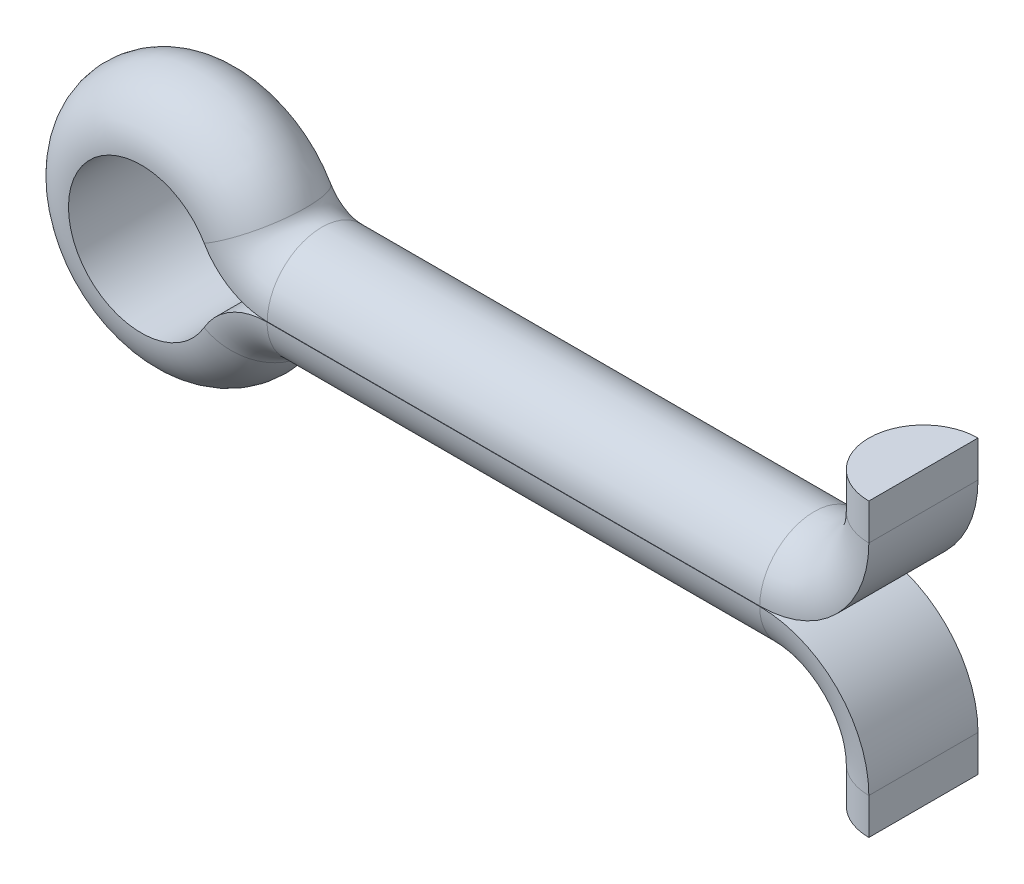
ISO-10303-21;
HEADER;
FILE_DESCRIPTION(('STEP AP214'),'2;1');
FILE_NAME('part.step','',(''),(''),'','','');
FILE_SCHEMA(('AUTOMOTIVE_DESIGN { 1 0 10303 214 1 1 1 1 }'));
ENDSEC;
DATA;
#1=APPLICATION_CONTEXT('core data for automotive mechanical design processes');
#2=APPLICATION_PROTOCOL_DEFINITION('international standard','automotive_design',2000,#1);
#3=PRODUCT_CONTEXT('',#1,'mechanical');
#4=PRODUCT('Part','Part','',(#3));
#5=PRODUCT_RELATED_PRODUCT_CATEGORY('part','',(#4));
#6=PRODUCT_DEFINITION_FORMATION('','',#4);
#7=PRODUCT_DEFINITION_CONTEXT('part definition',#1,'design');
#8=PRODUCT_DEFINITION('design','',#6,#7);
#9=PRODUCT_DEFINITION_SHAPE('','',#8);
#10=(LENGTH_UNIT() NAMED_UNIT(*) SI_UNIT(.MILLI.,.METRE.));
#11=(NAMED_UNIT(*) PLANE_ANGLE_UNIT() SI_UNIT($,.RADIAN.));
#12=(NAMED_UNIT(*) SI_UNIT($,.STERADIAN.) SOLID_ANGLE_UNIT());
#13=UNCERTAINTY_MEASURE_WITH_UNIT(LENGTH_MEASURE(1.E-05),#10,'distance_accuracy_value','');
#14=(GEOMETRIC_REPRESENTATION_CONTEXT(3) GLOBAL_UNCERTAINTY_ASSIGNED_CONTEXT((#13)) GLOBAL_UNIT_ASSIGNED_CONTEXT((#10,
#11,#12)) REPRESENTATION_CONTEXT('',''));
#15=CARTESIAN_POINT('',(0.,0.,0.));
#16=DIRECTION('',(0.,0.,1.));
#17=DIRECTION('',(1.,0.,0.));
#18=AXIS2_PLACEMENT_3D('',#15,#16,#17);
#19=CARTESIAN_POINT('',(20.,-4.00999999999986,0.));
#20=DIRECTION('',(0.,1.,0.));
#21=DIRECTION('',(0.,0.,1.));
#22=AXIS2_PLACEMENT_3D('',#19,#20,#21);
#23=PLANE('',#22);
#24=CARTESIAN_POINT('',(20.,-4.00999999999986,0.));
#25=DIRECTION('',(0.,1.,0.));
#26=DIRECTION('',(0.,0.,1.));
#27=AXIS2_PLACEMENT_3D('',#24,#25,#26);
#28=CIRCLE('',#27,1.5);
#29=CARTESIAN_POINT('',(20.,-4.00999999999986,-1.5));
#30=VERTEX_POINT('',#29);
#31=CARTESIAN_POINT('',(20.,-4.00999999999986,1.5));
#32=VERTEX_POINT('',#31);
#33=EDGE_CURVE('E103',#30,#32,#28,.T.);
#34=ORIENTED_EDGE('',*,*,#33,.F.);
#35=DIRECTION('',(0.,0.,-1.));
#36=VECTOR('',#35,1.);
#37=CARTESIAN_POINT('',(20.,-4.00999999999986,-1.5));
#38=LINE('',#37,#36);
#39=EDGE_CURVE('E105',#32,#30,#38,.T.);
#40=ORIENTED_EDGE('',*,*,#39,.F.);
#41=EDGE_LOOP('',(#34,#40));
#42=FACE_BOUND('',#41,.T.);
#43=ADVANCED_FACE('F33',(#42),#23,.F.);
#44=CARTESIAN_POINT('',(20.,4.,0.));
#45=DIRECTION('',(0.,1.,0.));
#46=DIRECTION('',(0.,0.,1.));
#47=AXIS2_PLACEMENT_3D('',#44,#45,#46);
#48=PLANE('',#47);
#49=CARTESIAN_POINT('',(20.,4.,0.));
#50=DIRECTION('',(0.,1.,0.));
#51=DIRECTION('',(0.,0.,1.));
#52=AXIS2_PLACEMENT_3D('',#49,#50,#51);
#53=CIRCLE('',#52,1.5);
#54=CARTESIAN_POINT('',(20.,4.,-1.5));
#55=VERTEX_POINT('',#54);
#56=CARTESIAN_POINT('',(20.,4.,1.5));
#57=VERTEX_POINT('',#56);
#58=EDGE_CURVE('E45',#55,#57,#53,.T.);
#59=ORIENTED_EDGE('',*,*,#58,.T.);
#60=DIRECTION('',(0.,0.,-1.));
#61=VECTOR('',#60,1.);
#62=CARTESIAN_POINT('',(20.,4.,-1.5));
#63=LINE('',#62,#61);
#64=EDGE_CURVE('E11',#57,#55,#63,.T.);
#65=ORIENTED_EDGE('',*,*,#64,.T.);
#66=EDGE_LOOP('',(#59,#65));
#67=FACE_BOUND('',#66,.T.);
#68=ADVANCED_FACE('F281',(#67),#48,.T.);
#69=CARTESIAN_POINT('',(20.,-4.00999999999986,0.));
#70=DIRECTION('',(0.,1.,0.));
#71=DIRECTION('',(-1.,0.,0.));
#72=AXIS2_PLACEMENT_3D('',#69,#70,#71);
#73=CYLINDRICAL_SURFACE('',#72,1.5);
#74=DIRECTION('',(0.,1.,0.));
#75=VECTOR('',#74,1.);
#76=CARTESIAN_POINT('',(20.,-4.00999999999986,1.5));
#77=LINE('',#76,#75);
#78=CARTESIAN_POINT('',(20.,-3.00999999999986,1.5));
#79=VERTEX_POINT('',#78);
#80=EDGE_CURVE('E116',#32,#79,#77,.T.);
#81=ORIENTED_EDGE('',*,*,#80,.T.);
#82=CARTESIAN_POINT('',(20.,-3.00999999999986,0.));
#83=DIRECTION('',(0.,1.,0.));
#84=DIRECTION('',(0.,0.,1.));
#85=AXIS2_PLACEMENT_3D('',#82,#83,#84);
#86=CIRCLE('',#85,1.5);
#87=CARTESIAN_POINT('',(20.,-3.00999999999986,-1.5));
#88=VERTEX_POINT('',#87);
#89=EDGE_CURVE('E121',#88,#79,#86,.T.);
#90=ORIENTED_EDGE('',*,*,#89,.F.);
#91=DIRECTION('',(0.,1.,0.));
#92=VECTOR('',#91,1.);
#93=CARTESIAN_POINT('',(20.,-4.00999999999986,-1.5));
#94=LINE('',#93,#92);
#95=EDGE_CURVE('E115',#30,#88,#94,.T.);
#96=ORIENTED_EDGE('',*,*,#95,.F.);
#97=ORIENTED_EDGE('',*,*,#33,.T.);
#98=EDGE_LOOP('',(#81,#90,#96,#97));
#99=FACE_BOUND('',#98,.T.);
#100=ADVANCED_FACE('F119',(#99),#73,.T.);
#101=CARTESIAN_POINT('',(20.,-4.00999999999986,-1.5));
#102=DIRECTION('',(1.,0.,0.));
#103=DIRECTION('',(0.,1.,0.));
#104=AXIS2_PLACEMENT_3D('',#101,#102,#103);
#105=PLANE('',#104);
#106=DIRECTION('',(0.,0.,-1.));
#107=VECTOR('',#106,1.);
#108=CARTESIAN_POINT('',(20.,-3.00999999999986,-1.5));
#109=LINE('',#108,#107);
#110=EDGE_CURVE('E136',#79,#88,#109,.T.);
#111=ORIENTED_EDGE('',*,*,#110,.F.);
#112=ORIENTED_EDGE('',*,*,#80,.F.);
#113=ORIENTED_EDGE('',*,*,#39,.T.);
#114=ORIENTED_EDGE('',*,*,#95,.T.);
#115=EDGE_LOOP('',(#111,#112,#113,#114));
#116=FACE_BOUND('',#115,.T.);
#117=ADVANCED_FACE('F114',(#116),#105,.T.);
#118=CARTESIAN_POINT('',(17.,-3.01,0.));
#119=DIRECTION('',(0.,0.,1.));
#120=DIRECTION('',(1.,0.,0.));
#121=AXIS2_PLACEMENT_3D('',#118,#119,#120);
#122=TOROIDAL_SURFACE('',#121,3.,1.5);
#123=CARTESIAN_POINT('',(17.,-3.01,1.5));
#124=DIRECTION('',(0.,0.,1.));
#125=DIRECTION('',(1.,0.,0.));
#126=AXIS2_PLACEMENT_3D('',#123,#124,#125);
#127=CIRCLE('',#126,3.);
#128=CARTESIAN_POINT('',(17.,-0.00999999999999699,1.5));
#129=VERTEX_POINT('',#128);
#130=EDGE_CURVE('E129',#79,#129,#127,.T.);
#131=ORIENTED_EDGE('',*,*,#130,.T.);
#132=CARTESIAN_POINT('',(17.,-0.00999999999999959,0.));
#133=DIRECTION('',(-1.,0.,0.));
#134=DIRECTION('',(0.,0.,1.));
#135=AXIS2_PLACEMENT_3D('',#132,#133,#134);
#136=CIRCLE('',#135,1.5);
#137=CARTESIAN_POINT('',(17.,-0.00999999999999699,-1.5));
#138=VERTEX_POINT('',#137);
#139=EDGE_CURVE('E126',#138,#129,#136,.T.);
#140=ORIENTED_EDGE('',*,*,#139,.F.);
#141=CARTESIAN_POINT('',(17.,-3.01,-1.5));
#142=DIRECTION('',(0.,0.,1.));
#143=DIRECTION('',(1.,0.,0.));
#144=AXIS2_PLACEMENT_3D('',#141,#142,#143);
#145=CIRCLE('',#144,3.);
#146=EDGE_CURVE('E130',#88,#138,#145,.T.);
#147=ORIENTED_EDGE('',*,*,#146,.F.);
#148=ORIENTED_EDGE('',*,*,#89,.T.);
#149=EDGE_LOOP('',(#131,#140,#147,#148));
#150=FACE_BOUND('',#149,.T.);
#151=ADVANCED_FACE('F260',(#150),#122,.T.);
#152=CARTESIAN_POINT('',(17.,-3.01,0.));
#153=DIRECTION('',(0.,0.,1.));
#154=DIRECTION('',(1.,0.,0.));
#155=AXIS2_PLACEMENT_3D('',#152,#153,#154);
#156=CYLINDRICAL_SURFACE('',#155,3.);
#157=DIRECTION('',(0.,0.,-1.));
#158=VECTOR('',#157,1.);
#159=CARTESIAN_POINT('',(17.,-0.00999999999999959,-1.5));
#160=LINE('',#159,#158);
#161=EDGE_CURVE('E133',#129,#138,#160,.T.);
#162=ORIENTED_EDGE('',*,*,#161,.F.);
#163=ORIENTED_EDGE('',*,*,#130,.F.);
#164=ORIENTED_EDGE('',*,*,#110,.T.);
#165=ORIENTED_EDGE('',*,*,#146,.T.);
#166=EDGE_LOOP('',(#162,#163,#164,#165));
#167=FACE_BOUND('',#166,.T.);
#168=ADVANCED_FACE('F261',(#167),#156,.T.);
#169=CARTESIAN_POINT('',(17.,-0.00999999999999959,0.));
#170=DIRECTION('',(-1.,0.,0.));
#171=DIRECTION('',(0.,0.,1.));
#172=AXIS2_PLACEMENT_3D('',#169,#170,#171);
#173=CYLINDRICAL_SURFACE('',#172,1.5);
#174=DIRECTION('',(-1.,0.,0.));
#175=VECTOR('',#174,1.);
#176=CARTESIAN_POINT('',(17.,-0.00999999999999959,1.5));
#177=LINE('',#176,#175);
#178=CARTESIAN_POINT('',(3.45830883525459,-0.00999999999999959,1.5));
#179=VERTEX_POINT('',#178);
#180=EDGE_CURVE('E140',#129,#179,#177,.T.);
#181=ORIENTED_EDGE('',*,*,#180,.T.);
#182=CARTESIAN_POINT('',(3.4583088352546,-0.00999999999999959,0.));
#183=DIRECTION('',(-1.,0.,0.));
#184=DIRECTION('',(0.,0.,1.));
#185=AXIS2_PLACEMENT_3D('',#182,#183,#184);
#186=CIRCLE('',#185,1.5);
#187=CARTESIAN_POINT('',(3.45830883525459,-0.00999999999999959,-1.5));
#188=VERTEX_POINT('',#187);
#189=EDGE_CURVE('E137',#188,#179,#186,.T.);
#190=ORIENTED_EDGE('',*,*,#189,.F.);
#191=DIRECTION('',(-1.,0.,0.));
#192=VECTOR('',#191,1.);
#193=CARTESIAN_POINT('',(17.,-0.00999999999999959,-1.5));
#194=LINE('',#193,#192);
#195=EDGE_CURVE('E141',#138,#188,#194,.T.);
#196=ORIENTED_EDGE('',*,*,#195,.F.);
#197=ORIENTED_EDGE('',*,*,#139,.T.);
#198=EDGE_LOOP('',(#181,#190,#196,#197));
#199=FACE_BOUND('',#198,.T.);
#200=ADVANCED_FACE('F254',(#199),#173,.T.);
#201=CARTESIAN_POINT('',(17.,-0.00999999999999959,-1.5));
#202=DIRECTION('',(0.,1.,0.));
#203=DIRECTION('',(0.,0.,1.));
#204=AXIS2_PLACEMENT_3D('',#201,#202,#203);
#205=PLANE('',#204);
#206=DIRECTION('',(0.,0.,-1.));
#207=VECTOR('',#206,1.);
#208=CARTESIAN_POINT('',(3.4583088352546,-0.00999999999999959,-1.5));
#209=LINE('',#208,#207);
#210=EDGE_CURVE('E144',#179,#188,#209,.T.);
#211=ORIENTED_EDGE('',*,*,#210,.F.);
#212=ORIENTED_EDGE('',*,*,#180,.F.);
#213=ORIENTED_EDGE('',*,*,#161,.T.);
#214=ORIENTED_EDGE('',*,*,#195,.T.);
#215=EDGE_LOOP('',(#211,#212,#213,#214));
#216=FACE_BOUND('',#215,.T.);
#217=ADVANCED_FACE('F255',(#216),#205,.T.);
#218=CARTESIAN_POINT('',(3.4583088352546,-2.01,0.));
#219=DIRECTION('',(0.,0.,1.));
#220=DIRECTION('',(1.,0.,0.));
#221=AXIS2_PLACEMENT_3D('',#218,#219,#220);
#222=TOROIDAL_SURFACE('',#221,2.,1.5);
#223=CARTESIAN_POINT('',(3.4583088352546,-2.01,1.5));
#224=DIRECTION('',(0.,0.,1.));
#225=DIRECTION('',(0.,1.,0.));
#226=AXIS2_PLACEMENT_3D('',#223,#224,#225);
#227=CIRCLE('',#226,2.);
#228=CARTESIAN_POINT('',(1.7291544176273,-1.005,1.5));
#229=VERTEX_POINT('',#228);
#230=EDGE_CURVE('E150',#179,#229,#227,.T.);
#231=ORIENTED_EDGE('',*,*,#230,.T.);
#232=CARTESIAN_POINT('',(1.7291544176273,-1.005,0.));
#233=DIRECTION('',(-0.5025,-0.864577208813649,0.));
#234=DIRECTION('',(0.,0.,1.));
#235=AXIS2_PLACEMENT_3D('',#232,#233,#234);
#236=CIRCLE('',#235,1.5);
#237=CARTESIAN_POINT('',(1.7291544176273,-1.005,-1.5));
#238=VERTEX_POINT('',#237);
#239=EDGE_CURVE('E147',#238,#229,#236,.T.);
#240=ORIENTED_EDGE('',*,*,#239,.F.);
#241=CARTESIAN_POINT('',(3.4583088352546,-2.01,-1.5));
#242=DIRECTION('',(0.,0.,1.));
#243=DIRECTION('',(0.,1.,0.));
#244=AXIS2_PLACEMENT_3D('',#241,#242,#243);
#245=CIRCLE('',#244,2.);
#246=EDGE_CURVE('E151',#188,#238,#245,.T.);
#247=ORIENTED_EDGE('',*,*,#246,.F.);
#248=ORIENTED_EDGE('',*,*,#189,.T.);
#249=EDGE_LOOP('',(#231,#240,#247,#248));
#250=FACE_BOUND('',#249,.T.);
#251=ADVANCED_FACE('F248',(#250),#222,.T.);
#252=CARTESIAN_POINT('',(3.4583088352546,-2.01,0.));
#253=DIRECTION('',(0.,0.,1.));
#254=DIRECTION('',(1.,0.,0.));
#255=AXIS2_PLACEMENT_3D('',#252,#253,#254);
#256=CYLINDRICAL_SURFACE('',#255,2.);
#257=DIRECTION('',(0.,0.,-1.));
#258=VECTOR('',#257,1.);
#259=CARTESIAN_POINT('',(1.7291544176273,-1.005,-1.5));
#260=LINE('',#259,#258);
#261=EDGE_CURVE('E154',#229,#238,#260,.T.);
#262=ORIENTED_EDGE('',*,*,#261,.F.);
#263=ORIENTED_EDGE('',*,*,#230,.F.);
#264=ORIENTED_EDGE('',*,*,#210,.T.);
#265=ORIENTED_EDGE('',*,*,#246,.T.);
#266=EDGE_LOOP('',(#262,#263,#264,#265));
#267=FACE_BOUND('',#266,.T.);
#268=ADVANCED_FACE('F249',(#267),#256,.T.);
#269=CARTESIAN_POINT('',(0.,0.,0.));
#270=DIRECTION('',(0.,0.,-1.));
#271=DIRECTION('',(-1.,0.,0.));
#272=AXIS2_PLACEMENT_3D('',#269,#270,#271);
#273=TOROIDAL_SURFACE('',#272,2.,1.5);
#274=CARTESIAN_POINT('',(0.,0.,1.5));
#275=DIRECTION('',(0.,0.,-1.));
#276=DIRECTION('',(0.864577208813649,-0.5025,0.));
#277=AXIS2_PLACEMENT_3D('',#274,#275,#276);
#278=CIRCLE('',#277,2.);
#279=CARTESIAN_POINT('',(1.73205080756888,0.999999999999998,1.5));
#280=VERTEX_POINT('',#279);
#281=EDGE_CURVE('E160',#229,#280,#278,.T.);
#282=ORIENTED_EDGE('',*,*,#281,.T.);
#283=CARTESIAN_POINT('',(1.73205080756888,0.999999999999999,0.));
#284=DIRECTION('',(0.5,-0.866025403784439,0.));
#285=DIRECTION('',(0.,0.,1.));
#286=AXIS2_PLACEMENT_3D('',#283,#284,#285);
#287=CIRCLE('',#286,1.5);
#288=CARTESIAN_POINT('',(1.73205080756888,0.999999999999998,-1.5));
#289=VERTEX_POINT('',#288);
#290=EDGE_CURVE('E157',#289,#280,#287,.T.);
#291=ORIENTED_EDGE('',*,*,#290,.F.);
#292=CARTESIAN_POINT('',(0.,0.,-1.5));
#293=DIRECTION('',(0.,0.,-1.));
#294=DIRECTION('',(0.864577208813649,-0.5025,0.));
#295=AXIS2_PLACEMENT_3D('',#292,#293,#294);
#296=CIRCLE('',#295,2.);
#297=EDGE_CURVE('E161',#238,#289,#296,.T.);
#298=ORIENTED_EDGE('',*,*,#297,.F.);
#299=ORIENTED_EDGE('',*,*,#239,.T.);
#300=EDGE_LOOP('',(#282,#291,#298,#299));
#301=FACE_BOUND('',#300,.T.);
#302=ADVANCED_FACE('F242',(#301),#273,.T.);
#303=CARTESIAN_POINT('',(0.,0.,0.));
#304=DIRECTION('',(0.,0.,-1.));
#305=DIRECTION('',(-1.,0.,0.));
#306=AXIS2_PLACEMENT_3D('',#303,#304,#305);
#307=CYLINDRICAL_SURFACE('',#306,2.);
#308=DIRECTION('',(0.,0.,-1.));
#309=VECTOR('',#308,1.);
#310=CARTESIAN_POINT('',(1.73205080756888,0.999999999999999,-1.5));
#311=LINE('',#310,#309);
#312=EDGE_CURVE('E164',#280,#289,#311,.T.);
#313=ORIENTED_EDGE('',*,*,#312,.F.);
#314=ORIENTED_EDGE('',*,*,#281,.F.);
#315=ORIENTED_EDGE('',*,*,#261,.T.);
#316=ORIENTED_EDGE('',*,*,#297,.T.);
#317=EDGE_LOOP('',(#313,#314,#315,#316));
#318=FACE_BOUND('',#317,.T.);
#319=ADVANCED_FACE('F243',(#318),#307,.F.);
#320=CARTESIAN_POINT('',(3.46410161513776,2.,0.));
#321=DIRECTION('',(0.,0.,1.));
#322=DIRECTION('',(1.,0.,0.));
#323=AXIS2_PLACEMENT_3D('',#320,#321,#322);
#324=TOROIDAL_SURFACE('',#323,2.,1.5);
#325=CARTESIAN_POINT('',(3.46410161513776,2.,1.5));
#326=DIRECTION('',(0.,0.,1.));
#327=DIRECTION('',(-0.866025403784438,-0.5,0.));
#328=AXIS2_PLACEMENT_3D('',#325,#326,#327);
#329=CIRCLE('',#328,2.);
#330=CARTESIAN_POINT('',(3.46410161513776,0.,1.5));
#331=VERTEX_POINT('',#330);
#332=EDGE_CURVE('E170',#280,#331,#329,.T.);
#333=ORIENTED_EDGE('',*,*,#332,.T.);
#334=CARTESIAN_POINT('',(3.46410161513776,0.,0.));
#335=DIRECTION('',(1.,0.,0.));
#336=DIRECTION('',(0.,0.,1.));
#337=AXIS2_PLACEMENT_3D('',#334,#335,#336);
#338=CIRCLE('',#337,1.5);
#339=CARTESIAN_POINT('',(3.46410161513776,0.,-1.5));
#340=VERTEX_POINT('',#339);
#341=EDGE_CURVE('E167',#340,#331,#338,.T.);
#342=ORIENTED_EDGE('',*,*,#341,.F.);
#343=CARTESIAN_POINT('',(3.46410161513776,2.,-1.5));
#344=DIRECTION('',(0.,0.,1.));
#345=DIRECTION('',(-0.866025403784438,-0.5,0.));
#346=AXIS2_PLACEMENT_3D('',#343,#344,#345);
#347=CIRCLE('',#346,2.);
#348=EDGE_CURVE('E171',#289,#340,#347,.T.);
#349=ORIENTED_EDGE('',*,*,#348,.F.);
#350=ORIENTED_EDGE('',*,*,#290,.T.);
#351=EDGE_LOOP('',(#333,#342,#349,#350));
#352=FACE_BOUND('',#351,.T.);
#353=ADVANCED_FACE('F236',(#352),#324,.T.);
#354=CARTESIAN_POINT('',(3.46410161513776,2.,0.));
#355=DIRECTION('',(0.,0.,1.));
#356=DIRECTION('',(1.,0.,0.));
#357=AXIS2_PLACEMENT_3D('',#354,#355,#356);
#358=CYLINDRICAL_SURFACE('',#357,2.);
#359=DIRECTION('',(0.,0.,-1.));
#360=VECTOR('',#359,1.);
#361=CARTESIAN_POINT('',(3.46410161513776,0.,-1.5));
#362=LINE('',#361,#360);
#363=EDGE_CURVE('E174',#331,#340,#362,.T.);
#364=ORIENTED_EDGE('',*,*,#363,.F.);
#365=ORIENTED_EDGE('',*,*,#332,.F.);
#366=ORIENTED_EDGE('',*,*,#312,.T.);
#367=ORIENTED_EDGE('',*,*,#348,.T.);
#368=EDGE_LOOP('',(#364,#365,#366,#367));
#369=FACE_BOUND('',#368,.T.);
#370=ADVANCED_FACE('F237',(#369),#358,.T.);
#371=CARTESIAN_POINT('',(3.46410161513776,0.,0.));
#372=DIRECTION('',(1.,0.,0.));
#373=DIRECTION('',(0.,0.,-1.));
#374=AXIS2_PLACEMENT_3D('',#371,#372,#373);
#375=CYLINDRICAL_SURFACE('',#374,1.5);
#376=DIRECTION('',(1.,0.,0.));
#377=VECTOR('',#376,1.);
#378=CARTESIAN_POINT('',(3.46410161513776,0.,1.5));
#379=LINE('',#378,#377);
#380=CARTESIAN_POINT('',(17.,0.,1.5));
#381=VERTEX_POINT('',#380);
#382=EDGE_CURVE('E180',#331,#381,#379,.T.);
#383=ORIENTED_EDGE('',*,*,#382,.T.);
#384=CARTESIAN_POINT('',(17.,0.,0.));
#385=DIRECTION('',(1.,0.,0.));
#386=DIRECTION('',(0.,0.,1.));
#387=AXIS2_PLACEMENT_3D('',#384,#385,#386);
#388=CIRCLE('',#387,1.5);
#389=CARTESIAN_POINT('',(17.,0.,-1.5));
#390=VERTEX_POINT('',#389);
#391=EDGE_CURVE('E177',#390,#381,#388,.T.);
#392=ORIENTED_EDGE('',*,*,#391,.F.);
#393=DIRECTION('',(1.,0.,0.));
#394=VECTOR('',#393,1.);
#395=CARTESIAN_POINT('',(3.46410161513776,0.,-1.5));
#396=LINE('',#395,#394);
#397=EDGE_CURVE('E181',#340,#390,#396,.T.);
#398=ORIENTED_EDGE('',*,*,#397,.F.);
#399=ORIENTED_EDGE('',*,*,#341,.T.);
#400=EDGE_LOOP('',(#383,#392,#398,#399));
#401=FACE_BOUND('',#400,.T.);
#402=ADVANCED_FACE('F230',(#401),#375,.T.);
#403=CARTESIAN_POINT('',(3.46410161513776,0.,-1.5));
#404=DIRECTION('',(0.,-1.,0.));
#405=DIRECTION('',(0.,0.,-1.));
#406=AXIS2_PLACEMENT_3D('',#403,#404,#405);
#407=PLANE('',#406);
#408=DIRECTION('',(0.,0.,-1.));
#409=VECTOR('',#408,1.);
#410=CARTESIAN_POINT('',(17.,0.,-1.5));
#411=LINE('',#410,#409);
#412=EDGE_CURVE('E184',#381,#390,#411,.T.);
#413=ORIENTED_EDGE('',*,*,#412,.F.);
#414=ORIENTED_EDGE('',*,*,#382,.F.);
#415=ORIENTED_EDGE('',*,*,#363,.T.);
#416=ORIENTED_EDGE('',*,*,#397,.T.);
#417=EDGE_LOOP('',(#413,#414,#415,#416));
#418=FACE_BOUND('',#417,.T.);
#419=ADVANCED_FACE('F231',(#418),#407,.T.);
#420=CARTESIAN_POINT('',(17.,3.,0.));
#421=DIRECTION('',(0.,0.,1.));
#422=DIRECTION('',(1.,0.,0.));
#423=AXIS2_PLACEMENT_3D('',#420,#421,#422);
#424=TOROIDAL_SURFACE('',#423,3.,1.5);
#425=CARTESIAN_POINT('',(17.,3.,1.5));
#426=DIRECTION('',(0.,0.,1.));
#427=DIRECTION('',(0.,-1.,0.));
#428=AXIS2_PLACEMENT_3D('',#425,#426,#427);
#429=CIRCLE('',#428,3.);
#430=CARTESIAN_POINT('',(20.,3.,1.5));
#431=VERTEX_POINT('',#430);
#432=EDGE_CURVE('E190',#381,#431,#429,.T.);
#433=ORIENTED_EDGE('',*,*,#432,.T.);
#434=CARTESIAN_POINT('',(20.,3.,0.));
#435=DIRECTION('',(0.,1.,0.));
#436=DIRECTION('',(0.,0.,1.));
#437=AXIS2_PLACEMENT_3D('',#434,#435,#436);
#438=CIRCLE('',#437,1.5);
#439=CARTESIAN_POINT('',(20.,3.,-1.5));
#440=VERTEX_POINT('',#439);
#441=EDGE_CURVE('E187',#440,#431,#438,.T.);
#442=ORIENTED_EDGE('',*,*,#441,.F.);
#443=CARTESIAN_POINT('',(17.,3.,-1.5));
#444=DIRECTION('',(0.,0.,1.));
#445=DIRECTION('',(0.,-1.,0.));
#446=AXIS2_PLACEMENT_3D('',#443,#444,#445);
#447=CIRCLE('',#446,3.);
#448=EDGE_CURVE('E191',#390,#440,#447,.T.);
#449=ORIENTED_EDGE('',*,*,#448,.F.);
#450=ORIENTED_EDGE('',*,*,#391,.T.);
#451=EDGE_LOOP('',(#433,#442,#449,#450));
#452=FACE_BOUND('',#451,.T.);
#453=ADVANCED_FACE('F223',(#452),#424,.T.);
#454=CARTESIAN_POINT('',(17.,3.,0.));
#455=DIRECTION('',(0.,0.,1.));
#456=DIRECTION('',(1.,0.,0.));
#457=AXIS2_PLACEMENT_3D('',#454,#455,#456);
#458=CYLINDRICAL_SURFACE('',#457,3.);
#459=DIRECTION('',(0.,0.,-1.));
#460=VECTOR('',#459,1.);
#461=CARTESIAN_POINT('',(20.,3.,-1.5));
#462=LINE('',#461,#460);
#463=EDGE_CURVE('E194',#431,#440,#462,.T.);
#464=ORIENTED_EDGE('',*,*,#463,.F.);
#465=ORIENTED_EDGE('',*,*,#432,.F.);
#466=ORIENTED_EDGE('',*,*,#412,.T.);
#467=ORIENTED_EDGE('',*,*,#448,.T.);
#468=EDGE_LOOP('',(#464,#465,#466,#467));
#469=FACE_BOUND('',#468,.T.);
#470=ADVANCED_FACE('F225',(#469),#458,.T.);
#471=CARTESIAN_POINT('',(20.,3.00000000000002,0.));
#472=DIRECTION('',(0.,1.,0.));
#473=DIRECTION('',(0.,0.,1.));
#474=AXIS2_PLACEMENT_3D('',#471,#472,#473);
#475=CYLINDRICAL_SURFACE('',#474,1.5);
#476=DIRECTION('',(0.,1.,0.));
#477=VECTOR('',#476,1.);
#478=CARTESIAN_POINT('',(20.,3.00000000000002,1.5));
#479=LINE('',#478,#477);
#480=EDGE_CURVE('E40',#431,#57,#479,.T.);
#481=ORIENTED_EDGE('',*,*,#480,.T.);
#482=ORIENTED_EDGE('',*,*,#58,.F.);
#483=DIRECTION('',(0.,1.,0.));
#484=VECTOR('',#483,1.);
#485=CARTESIAN_POINT('',(20.,3.00000000000002,-1.5));
#486=LINE('',#485,#484);
#487=EDGE_CURVE('E198',#440,#55,#486,.T.);
#488=ORIENTED_EDGE('',*,*,#487,.F.);
#489=ORIENTED_EDGE('',*,*,#441,.T.);
#490=EDGE_LOOP('',(#481,#482,#488,#489));
#491=FACE_BOUND('',#490,.T.);
#492=ADVANCED_FACE('F273',(#491),#475,.T.);
#493=CARTESIAN_POINT('',(20.,3.00000000000002,-1.5));
#494=DIRECTION('',(1.,0.,0.));
#495=DIRECTION('',(0.,0.,-1.));
#496=AXIS2_PLACEMENT_3D('',#493,#494,#495);
#497=PLANE('',#496);
#498=ORIENTED_EDGE('',*,*,#64,.F.);
#499=ORIENTED_EDGE('',*,*,#480,.F.);
#500=ORIENTED_EDGE('',*,*,#463,.T.);
#501=ORIENTED_EDGE('',*,*,#487,.T.);
#502=EDGE_LOOP('',(#498,#499,#500,#501));
#503=FACE_BOUND('',#502,.T.);
#504=ADVANCED_FACE('F220',(#503),#497,.T.);
#505=CLOSED_SHELL('',(#43,#68,#100,#117,#151,#168,#200,#217,#251,#268,#302,#319,#353,#370,#402,
#419,#453,#470,#492,#504));
#506=MANIFOLD_SOLID_BREP('B2',#505);
#507=ADVANCED_BREP_SHAPE_REPRESENTATION('',(#18,#506),#14);
#508=SHAPE_DEFINITION_REPRESENTATION(#9,#507);
ENDSEC;
END-ISO-10303-21;
